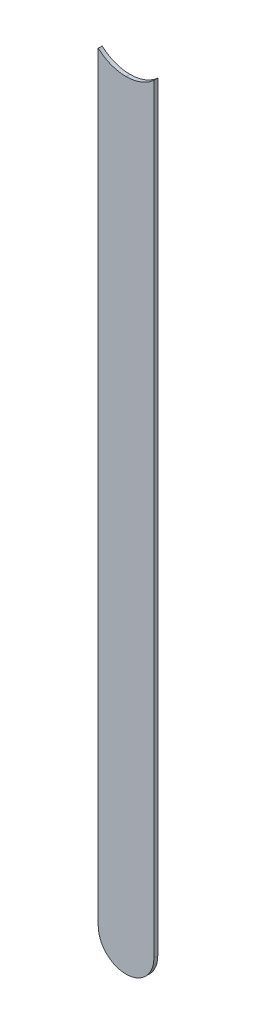
ISO-10303-21;
HEADER;
FILE_DESCRIPTION(('STEP AP214'),'2;1');
FILE_NAME('part.step','',(''),(''),'','','');
FILE_SCHEMA(('AUTOMOTIVE_DESIGN { 1 0 10303 214 1 1 1 1 }'));
ENDSEC;
DATA;
#1=APPLICATION_CONTEXT('core data for automotive mechanical design processes');
#2=APPLICATION_PROTOCOL_DEFINITION('international standard','automotive_design',2000,#1);
#3=PRODUCT_CONTEXT('',#1,'mechanical');
#4=PRODUCT('Part','Part','',(#3));
#5=PRODUCT_RELATED_PRODUCT_CATEGORY('part','',(#4));
#6=PRODUCT_DEFINITION_FORMATION('','',#4);
#7=PRODUCT_DEFINITION_CONTEXT('part definition',#1,'design');
#8=PRODUCT_DEFINITION('design','',#6,#7);
#9=PRODUCT_DEFINITION_SHAPE('','',#8);
#10=(LENGTH_UNIT() NAMED_UNIT(*) SI_UNIT(.MILLI.,.METRE.));
#11=(NAMED_UNIT(*) PLANE_ANGLE_UNIT() SI_UNIT($,.RADIAN.));
#12=(NAMED_UNIT(*) SI_UNIT($,.STERADIAN.) SOLID_ANGLE_UNIT());
#13=UNCERTAINTY_MEASURE_WITH_UNIT(LENGTH_MEASURE(1.E-05),#10,'distance_accuracy_value','');
#14=(GEOMETRIC_REPRESENTATION_CONTEXT(3) GLOBAL_UNCERTAINTY_ASSIGNED_CONTEXT((#13)) GLOBAL_UNIT_ASSIGNED_CONTEXT((#10,
#11,#12)) REPRESENTATION_CONTEXT('',''));
#15=CARTESIAN_POINT('',(0.,0.,0.));
#16=DIRECTION('',(0.,0.,1.));
#17=DIRECTION('',(1.,0.,0.));
#18=AXIS2_PLACEMENT_3D('',#15,#16,#17);
#19=CARTESIAN_POINT('',(144.78,-80.772,-0.045));
#20=DIRECTION('',(0.,0.,-1.));
#21=DIRECTION('',(0.,-1.,0.));
#22=AXIS2_PLACEMENT_3D('',#19,#20,#21);
#23=CYLINDRICAL_SURFACE('',#22,0.375);
#24=DIRECTION('',(0.,0.,1.));
#25=VECTOR('',#24,1.);
#26=CARTESIAN_POINT('',(144.78,-81.147,-0.045));
#27=LINE('',#26,#25);
#28=CARTESIAN_POINT('',(144.78,-81.147,-0.035));
#29=VERTEX_POINT('',#28);
#30=CARTESIAN_POINT('',(144.78,-81.147,0.));
#31=VERTEX_POINT('',#30);
#32=EDGE_CURVE('E57',#29,#31,#27,.T.);
#33=ORIENTED_EDGE('',*,*,#32,.F.);
#34=CARTESIAN_POINT('',(144.78,-80.772,-0.035));
#35=DIRECTION('',(0.,0.,-1.));
#36=DIRECTION('',(0.,-1.,0.));
#37=AXIS2_PLACEMENT_3D('',#34,#35,#36);
#38=CIRCLE('',#37,0.375);
#39=CARTESIAN_POINT('',(144.53,-81.05150849718,-0.035));
#40=VERTEX_POINT('',#39);
#41=EDGE_CURVE('E124',#29,#40,#38,.T.);
#42=ORIENTED_EDGE('',*,*,#41,.T.);
#43=DIRECTION('',(0.,0.,-1.));
#44=VECTOR('',#43,1.);
#45=CARTESIAN_POINT('',(144.53,-81.05150849718,-0.045));
#46=LINE('',#45,#44);
#47=CARTESIAN_POINT('',(144.53,-81.05150849718,0.));
#48=VERTEX_POINT('',#47);
#49=EDGE_CURVE('E11',#48,#40,#46,.T.);
#50=ORIENTED_EDGE('',*,*,#49,.F.);
#51=CARTESIAN_POINT('',(144.78,-80.772,0.));
#52=DIRECTION('',(0.,0.,-1.));
#53=DIRECTION('',(0.,-1.,0.));
#54=AXIS2_PLACEMENT_3D('',#51,#52,#53);
#55=CIRCLE('',#54,0.375);
#56=EDGE_CURVE('E131',#31,#48,#55,.T.);
#57=ORIENTED_EDGE('',*,*,#56,.F.);
#58=EDGE_LOOP('',(#33,#42,#50,#57));
#59=FACE_BOUND('',#58,.T.);
#60=ADVANCED_FACE('F17',(#59),#23,.F.);
#61=CARTESIAN_POINT('',(144.53,-80.772,-0.035));
#62=DIRECTION('',(1.,0.,0.));
#63=DIRECTION('',(0.,1.,0.));
#64=AXIS2_PLACEMENT_3D('',#61,#62,#63);
#65=PLANE('',#64);
#66=DIRECTION('',(0.,0.,1.));
#67=VECTOR('',#66,1.);
#68=CARTESIAN_POINT('',(144.53,-87.884,-0.035));
#69=LINE('',#68,#67);
#70=CARTESIAN_POINT('',(144.53,-87.884,-0.035));
#71=VERTEX_POINT('',#70);
#72=CARTESIAN_POINT('',(144.53,-87.884,0.));
#73=VERTEX_POINT('',#72);
#74=EDGE_CURVE('E26',#71,#73,#69,.T.);
#75=ORIENTED_EDGE('',*,*,#74,.T.);
#76=DIRECTION('',(0.,-1.,0.));
#77=VECTOR('',#76,1.);
#78=CARTESIAN_POINT('',(144.53,-80.772,0.));
#79=LINE('',#78,#77);
#80=EDGE_CURVE('E137',#48,#73,#79,.T.);
#81=ORIENTED_EDGE('',*,*,#80,.F.);
#82=ORIENTED_EDGE('',*,*,#49,.T.);
#83=DIRECTION('',(0.,-1.,0.));
#84=VECTOR('',#83,1.);
#85=CARTESIAN_POINT('',(144.53,-80.772,-0.035));
#86=LINE('',#85,#84);
#87=EDGE_CURVE('E121',#40,#71,#86,.T.);
#88=ORIENTED_EDGE('',*,*,#87,.T.);
#89=EDGE_LOOP('',(#75,#81,#82,#88));
#90=FACE_BOUND('',#89,.T.);
#91=ADVANCED_FACE('F19',(#90),#65,.F.);
#92=CARTESIAN_POINT('',(144.78,-87.884,-0.035));
#93=DIRECTION('',(0.,0.,-1.));
#94=DIRECTION('',(-1.,0.,0.));
#95=AXIS2_PLACEMENT_3D('',#92,#93,#94);
#96=CYLINDRICAL_SURFACE('',#95,0.25);
#97=CARTESIAN_POINT('',(144.78,-87.884,-0.035));
#98=DIRECTION('',(0.,0.,1.));
#99=DIRECTION('',(-1.,0.,0.));
#100=AXIS2_PLACEMENT_3D('',#97,#98,#99);
#101=CIRCLE('',#100,0.25);
#102=CARTESIAN_POINT('',(145.03,-87.884,-0.035));
#103=VERTEX_POINT('',#102);
#104=EDGE_CURVE('E133',#71,#103,#101,.T.);
#105=ORIENTED_EDGE('',*,*,#104,.T.);
#106=DIRECTION('',(0.,0.,1.));
#107=VECTOR('',#106,1.);
#108=CARTESIAN_POINT('',(145.03,-87.884,-0.035));
#109=LINE('',#108,#107);
#110=CARTESIAN_POINT('',(145.03,-87.884,0.));
#111=VERTEX_POINT('',#110);
#112=EDGE_CURVE('E104',#103,#111,#109,.T.);
#113=ORIENTED_EDGE('',*,*,#112,.T.);
#114=CARTESIAN_POINT('',(144.78,-87.884,0.));
#115=DIRECTION('',(0.,0.,1.));
#116=DIRECTION('',(-1.,0.,0.));
#117=AXIS2_PLACEMENT_3D('',#114,#115,#116);
#118=CIRCLE('',#117,0.25);
#119=EDGE_CURVE('E95',#73,#111,#118,.T.);
#120=ORIENTED_EDGE('',*,*,#119,.F.);
#121=ORIENTED_EDGE('',*,*,#74,.F.);
#122=EDGE_LOOP('',(#105,#113,#120,#121));
#123=FACE_BOUND('',#122,.T.);
#124=ADVANCED_FACE('F199',(#123),#96,.T.);
#125=CARTESIAN_POINT('',(145.03,-87.884,0.));
#126=DIRECTION('',(0.,0.,1.));
#127=DIRECTION('',(1.,0.,0.));
#128=AXIS2_PLACEMENT_3D('',#125,#126,#127);
#129=PLANE('',#128);
#130=ORIENTED_EDGE('',*,*,#119,.T.);
#131=DIRECTION('',(0.,1.,0.));
#132=VECTOR('',#131,1.);
#133=CARTESIAN_POINT('',(145.03,-87.884,0.));
#134=LINE('',#133,#132);
#135=CARTESIAN_POINT('',(145.03,-81.05150849719,0.));
#136=VERTEX_POINT('',#135);
#137=EDGE_CURVE('E98',#111,#136,#134,.T.);
#138=ORIENTED_EDGE('',*,*,#137,.T.);
#139=CARTESIAN_POINT('',(144.78,-80.772,0.));
#140=DIRECTION('',(0.,0.,-1.));
#141=DIRECTION('',(0.,-1.,0.));
#142=AXIS2_PLACEMENT_3D('',#139,#140,#141);
#143=CIRCLE('',#142,0.375);
#144=EDGE_CURVE('E87',#136,#31,#143,.T.);
#145=ORIENTED_EDGE('',*,*,#144,.T.);
#146=ORIENTED_EDGE('',*,*,#56,.T.);
#147=ORIENTED_EDGE('',*,*,#80,.T.);
#148=EDGE_LOOP('',(#130,#138,#145,#146,#147));
#149=FACE_BOUND('',#148,.T.);
#150=ADVANCED_FACE('F99',(#149),#129,.T.);
#151=CARTESIAN_POINT('',(144.78,-80.772,-0.045));
#152=DIRECTION('',(0.,0.,-1.));
#153=DIRECTION('',(0.,-1.,0.));
#154=AXIS2_PLACEMENT_3D('',#151,#152,#153);
#155=CYLINDRICAL_SURFACE('',#154,0.375);
#156=CARTESIAN_POINT('',(144.78,-80.772,-0.035));
#157=DIRECTION('',(0.,0.,-1.));
#158=DIRECTION('',(0.,-1.,0.));
#159=AXIS2_PLACEMENT_3D('',#156,#157,#158);
#160=CIRCLE('',#159,0.375);
#161=CARTESIAN_POINT('',(145.03,-81.05150849719,-0.035));
#162=VERTEX_POINT('',#161);
#163=EDGE_CURVE('E116',#162,#29,#160,.T.);
#164=ORIENTED_EDGE('',*,*,#163,.T.);
#165=ORIENTED_EDGE('',*,*,#32,.T.);
#166=ORIENTED_EDGE('',*,*,#144,.F.);
#167=DIRECTION('',(0.,0.,-1.));
#168=VECTOR('',#167,1.);
#169=CARTESIAN_POINT('',(145.03,-81.05150849718,-0.045));
#170=LINE('',#169,#168);
#171=EDGE_CURVE('E91',#136,#162,#170,.T.);
#172=ORIENTED_EDGE('',*,*,#171,.T.);
#173=EDGE_LOOP('',(#164,#165,#166,#172));
#174=FACE_BOUND('',#173,.T.);
#175=ADVANCED_FACE('F89',(#174),#155,.F.);
#176=CARTESIAN_POINT('',(145.03,-87.884,-0.035));
#177=DIRECTION('',(0.,0.,1.));
#178=DIRECTION('',(1.,0.,0.));
#179=AXIS2_PLACEMENT_3D('',#176,#177,#178);
#180=PLANE('',#179);
#181=ORIENTED_EDGE('',*,*,#87,.F.);
#182=ORIENTED_EDGE('',*,*,#41,.F.);
#183=ORIENTED_EDGE('',*,*,#163,.F.);
#184=DIRECTION('',(0.,1.,0.));
#185=VECTOR('',#184,1.);
#186=CARTESIAN_POINT('',(145.03,-87.884,-0.035));
#187=LINE('',#186,#185);
#188=EDGE_CURVE('E109',#103,#162,#187,.T.);
#189=ORIENTED_EDGE('',*,*,#188,.F.);
#190=ORIENTED_EDGE('',*,*,#104,.F.);
#191=EDGE_LOOP('',(#181,#182,#183,#189,#190));
#192=FACE_BOUND('',#191,.T.);
#193=ADVANCED_FACE('F191',(#192),#180,.F.);
#194=CARTESIAN_POINT('',(145.03,-87.884,-0.035));
#195=DIRECTION('',(-1.,0.,0.));
#196=DIRECTION('',(0.,0.,1.));
#197=AXIS2_PLACEMENT_3D('',#194,#195,#196);
#198=PLANE('',#197);
#199=ORIENTED_EDGE('',*,*,#171,.F.);
#200=ORIENTED_EDGE('',*,*,#137,.F.);
#201=ORIENTED_EDGE('',*,*,#112,.F.);
#202=ORIENTED_EDGE('',*,*,#188,.T.);
#203=EDGE_LOOP('',(#199,#200,#201,#202));
#204=FACE_BOUND('',#203,.T.);
#205=ADVANCED_FACE('F107',(#204),#198,.F.);
#206=CLOSED_SHELL('',(#60,#91,#124,#150,#175,#193,#205));
#207=MANIFOLD_SOLID_BREP('B1',#206);
#208=ADVANCED_BREP_SHAPE_REPRESENTATION('',(#18,#207),#14);
#209=SHAPE_DEFINITION_REPRESENTATION(#9,#208);
ENDSEC;
END-ISO-10303-21;
